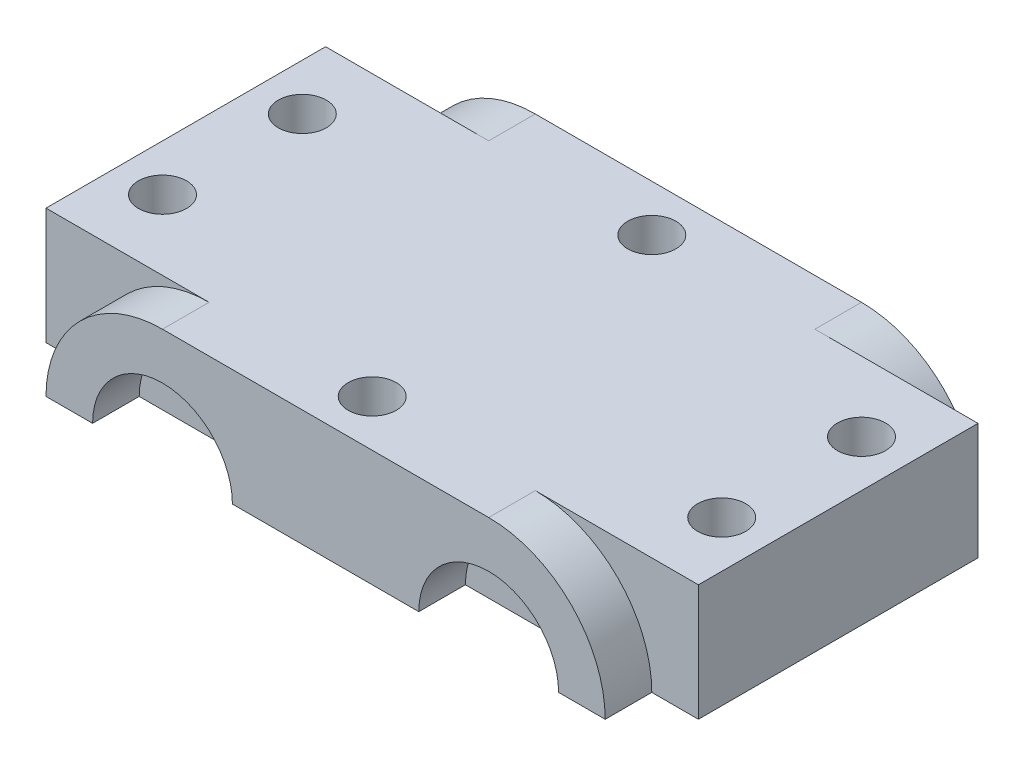
ISO-10303-21;
HEADER;
FILE_DESCRIPTION(('STEP AP214'),'2;1');
FILE_NAME('part.step','',(''),(''),'','','');
FILE_SCHEMA(('AUTOMOTIVE_DESIGN { 1 0 10303 214 1 1 1 1 }'));
ENDSEC;
DATA;
#1=APPLICATION_CONTEXT('core data for automotive mechanical design processes');
#2=APPLICATION_PROTOCOL_DEFINITION('international standard','automotive_design',2000,#1);
#3=PRODUCT_CONTEXT('',#1,'mechanical');
#4=PRODUCT('Part','Part','',(#3));
#5=PRODUCT_RELATED_PRODUCT_CATEGORY('part','',(#4));
#6=PRODUCT_DEFINITION_FORMATION('','',#4);
#7=PRODUCT_DEFINITION_CONTEXT('part definition',#1,'design');
#8=PRODUCT_DEFINITION('design','',#6,#7);
#9=PRODUCT_DEFINITION_SHAPE('','',#8);
#10=(LENGTH_UNIT() NAMED_UNIT(*) SI_UNIT(.MILLI.,.METRE.));
#11=(NAMED_UNIT(*) PLANE_ANGLE_UNIT() SI_UNIT($,.RADIAN.));
#12=(NAMED_UNIT(*) SI_UNIT($,.STERADIAN.) SOLID_ANGLE_UNIT());
#13=UNCERTAINTY_MEASURE_WITH_UNIT(LENGTH_MEASURE(1.E-05),#10,'distance_accuracy_value','');
#14=(GEOMETRIC_REPRESENTATION_CONTEXT(3) GLOBAL_UNCERTAINTY_ASSIGNED_CONTEXT((#13)) GLOBAL_UNIT_ASSIGNED_CONTEXT((#10,
#11,#12)) REPRESENTATION_CONTEXT('',''));
#15=CARTESIAN_POINT('',(0.,0.,0.));
#16=DIRECTION('',(0.,0.,1.));
#17=DIRECTION('',(1.,0.,0.));
#18=AXIS2_PLACEMENT_3D('',#15,#16,#17);
#19=CARTESIAN_POINT('',(0.,0.,-76.2));
#20=DIRECTION('',(0.,0.,-1.));
#21=DIRECTION('',(-1.,0.,0.));
#22=AXIS2_PLACEMENT_3D('',#19,#20,#21);
#23=PLANE('',#22);
#24=CARTESIAN_POINT('',(-44.45,-15.875,-76.2));
#25=DIRECTION('',(0.,0.,-1.));
#26=DIRECTION('',(-1.,0.,0.));
#27=AXIS2_PLACEMENT_3D('',#24,#25,#26);
#28=CIRCLE('',#27,31.75);
#29=CARTESIAN_POINT('',(-76.2,-15.875,-76.2));
#30=VERTEX_POINT('',#29);
#31=CARTESIAN_POINT('',(-44.45,15.875,-76.2));
#32=VERTEX_POINT('',#31);
#33=EDGE_CURVE('E196',#30,#32,#28,.T.);
#34=ORIENTED_EDGE('',*,*,#33,.F.);
#35=DIRECTION('',(1.,0.,0.));
#36=VECTOR('',#35,1.);
#37=CARTESIAN_POINT('',(-88.9,-15.875,-76.2));
#38=LINE('',#37,#36);
#39=CARTESIAN_POINT('',(-88.9,-15.875,-76.2));
#40=VERTEX_POINT('',#39);
#41=EDGE_CURVE('E261',#40,#30,#38,.T.);
#42=ORIENTED_EDGE('',*,*,#41,.F.);
#43=DIRECTION('',(0.,-1.,0.));
#44=VECTOR('',#43,1.);
#45=CARTESIAN_POINT('',(-88.9,-15.875,-76.2));
#46=LINE('',#45,#44);
#47=CARTESIAN_POINT('',(-88.9,15.875,-76.2));
#48=VERTEX_POINT('',#47);
#49=EDGE_CURVE('E256',#48,#40,#46,.T.);
#50=ORIENTED_EDGE('',*,*,#49,.F.);
#51=DIRECTION('',(-1.,0.,0.));
#52=VECTOR('',#51,1.);
#53=CARTESIAN_POINT('',(-88.9,15.875,-76.2));
#54=LINE('',#53,#52);
#55=EDGE_CURVE('E268',#32,#48,#54,.T.);
#56=ORIENTED_EDGE('',*,*,#55,.F.);
#57=EDGE_LOOP('',(#34,#42,#50,#56));
#58=FACE_BOUND('',#57,.T.);
#59=ADVANCED_FACE('F35',(#58),#23,.T.);
#60=CARTESIAN_POINT('',(-44.45,-15.875,-76.2));
#61=DIRECTION('',(0.,0.,1.));
#62=DIRECTION('',(-1.,0.,0.));
#63=AXIS2_PLACEMENT_3D('',#60,#61,#62);
#64=CIRCLE('',#63,19.05);
#65=CARTESIAN_POINT('',(-25.4,-15.875,-76.2));
#66=VERTEX_POINT('',#65);
#67=CARTESIAN_POINT('',(-63.5,-15.875,-76.2));
#68=VERTEX_POINT('',#67);
#69=EDGE_CURVE('E193',#66,#68,#64,.T.);
#70=ORIENTED_EDGE('',*,*,#69,.F.);
#71=EDGE_CURVE('E265',#68,#66,#38,.T.);
#72=ORIENTED_EDGE('',*,*,#71,.F.);
#73=EDGE_LOOP('',(#70,#72));
#74=FACE_BOUND('',#73,.T.);
#75=ADVANCED_FACE('F418',(#74),#23,.T.);
#76=CARTESIAN_POINT('',(44.45,-15.875,-76.2));
#77=DIRECTION('',(0.,0.,1.));
#78=DIRECTION('',(-1.,0.,0.));
#79=AXIS2_PLACEMENT_3D('',#76,#77,#78);
#80=CIRCLE('',#79,19.05);
#81=CARTESIAN_POINT('',(63.5,-15.875,-76.2));
#82=VERTEX_POINT('',#81);
#83=CARTESIAN_POINT('',(25.4,-15.875,-76.2));
#84=VERTEX_POINT('',#83);
#85=EDGE_CURVE('E51',#82,#84,#80,.T.);
#86=ORIENTED_EDGE('',*,*,#85,.F.);
#87=EDGE_CURVE('E54',#84,#82,#38,.T.);
#88=ORIENTED_EDGE('',*,*,#87,.F.);
#89=EDGE_LOOP('',(#86,#88));
#90=FACE_BOUND('',#89,.T.);
#91=ADVANCED_FACE('F424',(#90),#23,.T.);
#92=CARTESIAN_POINT('',(0.,0.,0.));
#93=DIRECTION('',(0.,0.,-1.));
#94=DIRECTION('',(-1.,0.,0.));
#95=AXIS2_PLACEMENT_3D('',#92,#93,#94);
#96=PLANE('',#95);
#97=CARTESIAN_POINT('',(44.45,-15.875,0.));
#98=DIRECTION('',(0.,0.,1.));
#99=DIRECTION('',(1.,0.,0.));
#100=AXIS2_PLACEMENT_3D('',#97,#98,#99);
#101=CIRCLE('',#100,31.75);
#102=CARTESIAN_POINT('',(76.2,-15.875,0.));
#103=VERTEX_POINT('',#102);
#104=CARTESIAN_POINT('',(44.45,15.875,0.));
#105=VERTEX_POINT('',#104);
#106=EDGE_CURVE('E197',#103,#105,#101,.T.);
#107=ORIENTED_EDGE('',*,*,#106,.F.);
#108=DIRECTION('',(1.,0.,0.));
#109=VECTOR('',#108,1.);
#110=CARTESIAN_POINT('',(-88.9,-15.875,0.));
#111=LINE('',#110,#109);
#112=CARTESIAN_POINT('',(88.9,-15.875,0.));
#113=VERTEX_POINT('',#112);
#114=EDGE_CURVE('E273',#103,#113,#111,.T.);
#115=ORIENTED_EDGE('',*,*,#114,.T.);
#116=DIRECTION('',(0.,1.,0.));
#117=VECTOR('',#116,1.);
#118=CARTESIAN_POINT('',(88.9,-15.875,0.));
#119=LINE('',#118,#117);
#120=CARTESIAN_POINT('',(88.9,15.875,0.));
#121=VERTEX_POINT('',#120);
#122=EDGE_CURVE('E276',#113,#121,#119,.T.);
#123=ORIENTED_EDGE('',*,*,#122,.T.);
#124=DIRECTION('',(-1.,0.,0.));
#125=VECTOR('',#124,1.);
#126=CARTESIAN_POINT('',(-88.9,15.875,0.));
#127=LINE('',#126,#125);
#128=EDGE_CURVE('E260',#121,#105,#127,.T.);
#129=ORIENTED_EDGE('',*,*,#128,.T.);
#130=EDGE_LOOP('',(#107,#115,#123,#129));
#131=FACE_BOUND('',#130,.T.);
#132=ADVANCED_FACE('F434',(#131),#96,.F.);
#133=CARTESIAN_POINT('',(44.45,-15.875,0.));
#134=DIRECTION('',(0.,0.,-1.));
#135=DIRECTION('',(-1.,0.,0.));
#136=AXIS2_PLACEMENT_3D('',#133,#134,#135);
#137=CIRCLE('',#136,19.05);
#138=CARTESIAN_POINT('',(25.4,-15.875,0.));
#139=VERTEX_POINT('',#138);
#140=CARTESIAN_POINT('',(63.5,-15.875,0.));
#141=VERTEX_POINT('',#140);
#142=EDGE_CURVE('E210',#139,#141,#137,.T.);
#143=ORIENTED_EDGE('',*,*,#142,.F.);
#144=EDGE_CURVE('E457',#139,#141,#111,.T.);
#145=ORIENTED_EDGE('',*,*,#144,.T.);
#146=EDGE_LOOP('',(#143,#145));
#147=FACE_BOUND('',#146,.T.);
#148=ADVANCED_FACE('F440',(#147),#96,.F.);
#149=CARTESIAN_POINT('',(-44.45,-15.875,0.));
#150=DIRECTION('',(0.,0.,-1.));
#151=DIRECTION('',(-1.,0.,0.));
#152=AXIS2_PLACEMENT_3D('',#149,#150,#151);
#153=CIRCLE('',#152,19.05);
#154=CARTESIAN_POINT('',(-63.5,-15.875,0.));
#155=VERTEX_POINT('',#154);
#156=CARTESIAN_POINT('',(-25.4,-15.875,0.));
#157=VERTEX_POINT('',#156);
#158=EDGE_CURVE('E227',#155,#157,#153,.T.);
#159=ORIENTED_EDGE('',*,*,#158,.F.);
#160=EDGE_CURVE('E277',#155,#157,#111,.T.);
#161=ORIENTED_EDGE('',*,*,#160,.T.);
#162=EDGE_LOOP('',(#159,#161));
#163=FACE_BOUND('',#162,.T.);
#164=ADVANCED_FACE('F435',(#163),#96,.F.);
#165=CARTESIAN_POINT('',(-88.9,-15.875,-76.2));
#166=DIRECTION('',(-1.,0.,0.));
#167=DIRECTION('',(0.,0.,1.));
#168=AXIS2_PLACEMENT_3D('',#165,#166,#167);
#169=PLANE('',#168);
#170=DIRECTION('',(0.,-1.,0.));
#171=VECTOR('',#170,1.);
#172=CARTESIAN_POINT('',(-88.9,-15.875,0.));
#173=LINE('',#172,#171);
#174=CARTESIAN_POINT('',(-88.9,15.875,0.));
#175=VERTEX_POINT('',#174);
#176=CARTESIAN_POINT('',(-88.9,-15.875,0.));
#177=VERTEX_POINT('',#176);
#178=EDGE_CURVE('E255',#175,#177,#173,.T.);
#179=ORIENTED_EDGE('',*,*,#178,.F.);
#180=DIRECTION('',(0.,0.,1.));
#181=VECTOR('',#180,1.);
#182=CARTESIAN_POINT('',(-88.9,15.875,-76.2));
#183=LINE('',#182,#181);
#184=EDGE_CURVE('E11',#48,#175,#183,.T.);
#185=ORIENTED_EDGE('',*,*,#184,.F.);
#186=ORIENTED_EDGE('',*,*,#49,.T.);
#187=DIRECTION('',(0.,0.,1.));
#188=VECTOR('',#187,1.);
#189=CARTESIAN_POINT('',(-88.9,-15.875,-76.2));
#190=LINE('',#189,#188);
#191=EDGE_CURVE('E39',#40,#177,#190,.T.);
#192=ORIENTED_EDGE('',*,*,#191,.T.);
#193=EDGE_LOOP('',(#179,#185,#186,#192));
#194=FACE_BOUND('',#193,.T.);
#195=ADVANCED_FACE('F37',(#194),#169,.T.);
#196=CARTESIAN_POINT('',(-88.9,15.875,-76.2));
#197=DIRECTION('',(0.,1.,0.));
#198=DIRECTION('',(-1.,0.,0.));
#199=AXIS2_PLACEMENT_3D('',#196,#197,#198);
#200=PLANE('',#199);
#201=CARTESIAN_POINT('',(0.,15.875,0.));
#202=DIRECTION('',(0.,1.,0.));
#203=DIRECTION('',(-1.,0.,0.));
#204=AXIS2_PLACEMENT_3D('',#201,#202,#203);
#205=CIRCLE('',#204,6.5532);
#206=CARTESIAN_POINT('',(-6.5532,15.875,0.));
#207=VERTEX_POINT('',#206);
#208=EDGE_CURVE('E362',#207,#207,#205,.T.);
#209=ORIENTED_EDGE('',*,*,#208,.F.);
#210=EDGE_LOOP('',(#209));
#211=FACE_BOUND('',#210,.T.);
#212=CARTESIAN_POINT('',(76.2,15.875,-19.05));
#213=DIRECTION('',(0.,1.,0.));
#214=DIRECTION('',(-1.,0.,0.));
#215=AXIS2_PLACEMENT_3D('',#212,#213,#214);
#216=CIRCLE('',#215,6.55319999999999);
#217=CARTESIAN_POINT('',(69.6468,15.875,-19.05));
#218=VERTEX_POINT('',#217);
#219=EDGE_CURVE('E348',#218,#218,#216,.T.);
#220=ORIENTED_EDGE('',*,*,#219,.F.);
#221=EDGE_LOOP('',(#220));
#222=FACE_BOUND('',#221,.T.);
#223=CARTESIAN_POINT('',(-76.2,15.875,-57.15));
#224=DIRECTION('',(0.,1.,0.));
#225=DIRECTION('',(-1.,0.,0.));
#226=AXIS2_PLACEMENT_3D('',#223,#224,#225);
#227=CIRCLE('',#226,6.55319999999999);
#228=CARTESIAN_POINT('',(-82.7532,15.875,-57.15));
#229=VERTEX_POINT('',#228);
#230=EDGE_CURVE('E368',#229,#229,#227,.T.);
#231=ORIENTED_EDGE('',*,*,#230,.F.);
#232=EDGE_LOOP('',(#231));
#233=FACE_BOUND('',#232,.T.);
#234=CARTESIAN_POINT('',(76.2,15.875,-57.15));
#235=DIRECTION('',(0.,1.,0.));
#236=DIRECTION('',(-1.,0.,0.));
#237=AXIS2_PLACEMENT_3D('',#234,#235,#236);
#238=CIRCLE('',#237,6.55319999999999);
#239=CARTESIAN_POINT('',(69.6468,15.875,-57.15));
#240=VERTEX_POINT('',#239);
#241=EDGE_CURVE('E349',#240,#240,#238,.T.);
#242=ORIENTED_EDGE('',*,*,#241,.F.);
#243=EDGE_LOOP('',(#242));
#244=FACE_BOUND('',#243,.T.);
#245=CARTESIAN_POINT('',(-76.2,15.875,-19.05));
#246=DIRECTION('',(0.,1.,0.));
#247=DIRECTION('',(-1.,0.,0.));
#248=AXIS2_PLACEMENT_3D('',#245,#246,#247);
#249=CIRCLE('',#248,6.55319999999999);
#250=CARTESIAN_POINT('',(-82.7532,15.875,-19.05));
#251=VERTEX_POINT('',#250);
#252=EDGE_CURVE('E356',#251,#251,#249,.T.);
#253=ORIENTED_EDGE('',*,*,#252,.F.);
#254=EDGE_LOOP('',(#253));
#255=FACE_BOUND('',#254,.T.);
#256=CARTESIAN_POINT('',(0.,15.875,-76.2));
#257=DIRECTION('',(0.,1.,0.));
#258=DIRECTION('',(-1.,0.,0.));
#259=AXIS2_PLACEMENT_3D('',#256,#257,#258);
#260=CIRCLE('',#259,6.5532);
#261=CARTESIAN_POINT('',(-6.5532,15.875,-76.2));
#262=VERTEX_POINT('',#261);
#263=EDGE_CURVE('E342',#262,#262,#260,.T.);
#264=ORIENTED_EDGE('',*,*,#263,.F.);
#265=EDGE_LOOP('',(#264));
#266=FACE_BOUND('',#265,.T.);
#267=ORIENTED_EDGE('',*,*,#128,.F.);
#268=DIRECTION('',(0.,0.,1.));
#269=VECTOR('',#268,1.);
#270=CARTESIAN_POINT('',(88.9,15.875,-76.2));
#271=LINE('',#270,#269);
#272=CARTESIAN_POINT('',(88.9,15.875,-76.2));
#273=VERTEX_POINT('',#272);
#274=EDGE_CURVE('E44',#273,#121,#271,.T.);
#275=ORIENTED_EDGE('',*,*,#274,.F.);
#276=CARTESIAN_POINT('',(44.45,15.875,-76.2));
#277=VERTEX_POINT('',#276);
#278=EDGE_CURVE('E269',#273,#277,#54,.T.);
#279=ORIENTED_EDGE('',*,*,#278,.T.);
#280=DIRECTION('',(0.,0.,1.));
#281=VECTOR('',#280,1.);
#282=CARTESIAN_POINT('',(44.45,15.875,-88.9));
#283=LINE('',#282,#281);
#284=CARTESIAN_POINT('',(44.45,15.875,-88.9));
#285=VERTEX_POINT('',#284);
#286=EDGE_CURVE('E180',#285,#277,#283,.T.);
#287=ORIENTED_EDGE('',*,*,#286,.F.);
#288=DIRECTION('',(1.,0.,0.));
#289=VECTOR('',#288,1.);
#290=CARTESIAN_POINT('',(44.45,15.875,-88.9));
#291=LINE('',#290,#289);
#292=CARTESIAN_POINT('',(-44.45,15.875,-88.9));
#293=VERTEX_POINT('',#292);
#294=EDGE_CURVE('E171',#293,#285,#291,.T.);
#295=ORIENTED_EDGE('',*,*,#294,.F.);
#296=DIRECTION('',(0.,0.,1.));
#297=VECTOR('',#296,1.);
#298=CARTESIAN_POINT('',(-44.45,15.875,-88.9));
#299=LINE('',#298,#297);
#300=EDGE_CURVE('E176',#293,#32,#299,.T.);
#301=ORIENTED_EDGE('',*,*,#300,.T.);
#302=ORIENTED_EDGE('',*,*,#55,.T.);
#303=ORIENTED_EDGE('',*,*,#184,.T.);
#304=CARTESIAN_POINT('',(-44.45,15.875,0.));
#305=VERTEX_POINT('',#304);
#306=EDGE_CURVE('E280',#305,#175,#127,.T.);
#307=ORIENTED_EDGE('',*,*,#306,.F.);
#308=DIRECTION('',(0.,0.,-1.));
#309=VECTOR('',#308,1.);
#310=CARTESIAN_POINT('',(-44.45,15.875,12.7));
#311=LINE('',#310,#309);
#312=CARTESIAN_POINT('',(-44.45,15.875,12.7));
#313=VERTEX_POINT('',#312);
#314=EDGE_CURVE('E249',#313,#305,#311,.T.);
#315=ORIENTED_EDGE('',*,*,#314,.F.);
#316=DIRECTION('',(-1.,0.,0.));
#317=VECTOR('',#316,1.);
#318=CARTESIAN_POINT('',(44.45,15.875,12.7));
#319=LINE('',#318,#317);
#320=CARTESIAN_POINT('',(44.45,15.875,12.7));
#321=VERTEX_POINT('',#320);
#322=EDGE_CURVE('E209',#321,#313,#319,.T.);
#323=ORIENTED_EDGE('',*,*,#322,.F.);
#324=DIRECTION('',(0.,0.,-1.));
#325=VECTOR('',#324,1.);
#326=CARTESIAN_POINT('',(44.45,15.875,12.7));
#327=LINE('',#326,#325);
#328=EDGE_CURVE('E252',#321,#105,#327,.T.);
#329=ORIENTED_EDGE('',*,*,#328,.T.);
#330=EDGE_LOOP('',(#267,#275,#279,#287,#295,#301,#302,#303,#307,#315,#323,#329));
#331=FACE_BOUND('',#330,.T.);
#332=ADVANCED_FACE('F174',(#211,#222,#233,#244,#255,#266,#331),#200,.T.);
#333=CARTESIAN_POINT('',(88.9,-15.875,-76.2));
#334=DIRECTION('',(1.,0.,0.));
#335=DIRECTION('',(0.,0.,-1.));
#336=AXIS2_PLACEMENT_3D('',#333,#334,#335);
#337=PLANE('',#336);
#338=ORIENTED_EDGE('',*,*,#122,.F.);
#339=DIRECTION('',(0.,0.,1.));
#340=VECTOR('',#339,1.);
#341=CARTESIAN_POINT('',(88.9,-15.875,-76.2));
#342=LINE('',#341,#340);
#343=CARTESIAN_POINT('',(88.9,-15.875,-76.2));
#344=VERTEX_POINT('',#343);
#345=EDGE_CURVE('E282',#344,#113,#342,.T.);
#346=ORIENTED_EDGE('',*,*,#345,.F.);
#347=DIRECTION('',(0.,1.,0.));
#348=VECTOR('',#347,1.);
#349=CARTESIAN_POINT('',(88.9,-15.875,-76.2));
#350=LINE('',#349,#348);
#351=EDGE_CURVE('E264',#344,#273,#350,.T.);
#352=ORIENTED_EDGE('',*,*,#351,.T.);
#353=ORIENTED_EDGE('',*,*,#274,.T.);
#354=EDGE_LOOP('',(#338,#346,#352,#353));
#355=FACE_BOUND('',#354,.T.);
#356=ADVANCED_FACE('F389',(#355),#337,.T.);
#357=CARTESIAN_POINT('',(-88.9,-15.875,-76.2));
#358=DIRECTION('',(0.,-1.,0.));
#359=DIRECTION('',(1.,0.,0.));
#360=AXIS2_PLACEMENT_3D('',#357,#358,#359);
#361=PLANE('',#360);
#362=CARTESIAN_POINT('',(0.,-15.875,0.));
#363=DIRECTION('',(0.,1.,0.));
#364=DIRECTION('',(-1.,0.,0.));
#365=AXIS2_PLACEMENT_3D('',#362,#363,#364);
#366=CIRCLE('',#365,6.5532);
#367=CARTESIAN_POINT('',(-6.5532,-15.875,0.));
#368=VERTEX_POINT('',#367);
#369=EDGE_CURVE('E332',#368,#368,#366,.T.);
#370=ORIENTED_EDGE('',*,*,#369,.T.);
#371=EDGE_LOOP('',(#370));
#372=FACE_BOUND('',#371,.T.);
#373=CARTESIAN_POINT('',(76.2,-15.875,-19.05));
#374=DIRECTION('',(0.,1.,0.));
#375=DIRECTION('',(-1.,0.,0.));
#376=AXIS2_PLACEMENT_3D('',#373,#374,#375);
#377=CIRCLE('',#376,6.55319999999999);
#378=CARTESIAN_POINT('',(69.6468,-15.875,-19.05));
#379=VERTEX_POINT('',#378);
#380=EDGE_CURVE('E365',#379,#379,#377,.T.);
#381=ORIENTED_EDGE('',*,*,#380,.T.);
#382=EDGE_LOOP('',(#381));
#383=FACE_BOUND('',#382,.T.);
#384=CARTESIAN_POINT('',(-76.2,-15.875,-57.15));
#385=DIRECTION('',(0.,1.,0.));
#386=DIRECTION('',(-1.,0.,0.));
#387=AXIS2_PLACEMENT_3D('',#384,#385,#386);
#388=CIRCLE('',#387,6.55319999999999);
#389=CARTESIAN_POINT('',(-82.7532,-15.875,-57.15));
#390=VERTEX_POINT('',#389);
#391=EDGE_CURVE('E353',#390,#390,#388,.T.);
#392=ORIENTED_EDGE('',*,*,#391,.T.);
#393=EDGE_LOOP('',(#392));
#394=FACE_BOUND('',#393,.T.);
#395=CARTESIAN_POINT('',(76.2,-15.875,-57.15));
#396=DIRECTION('',(0.,1.,0.));
#397=DIRECTION('',(-1.,0.,0.));
#398=AXIS2_PLACEMENT_3D('',#395,#396,#397);
#399=CIRCLE('',#398,6.55319999999999);
#400=CARTESIAN_POINT('',(69.6468,-15.875,-57.15));
#401=VERTEX_POINT('',#400);
#402=EDGE_CURVE('E352',#401,#401,#399,.T.);
#403=ORIENTED_EDGE('',*,*,#402,.T.);
#404=EDGE_LOOP('',(#403));
#405=FACE_BOUND('',#404,.T.);
#406=CARTESIAN_POINT('',(-76.2,-15.875,-19.05));
#407=DIRECTION('',(0.,1.,0.));
#408=DIRECTION('',(-1.,0.,0.));
#409=AXIS2_PLACEMENT_3D('',#406,#407,#408);
#410=CIRCLE('',#409,6.55319999999999);
#411=CARTESIAN_POINT('',(-82.7532,-15.875,-19.05));
#412=VERTEX_POINT('',#411);
#413=EDGE_CURVE('E359',#412,#412,#410,.T.);
#414=ORIENTED_EDGE('',*,*,#413,.T.);
#415=EDGE_LOOP('',(#414));
#416=FACE_BOUND('',#415,.T.);
#417=CARTESIAN_POINT('',(0.,-15.875,-76.2));
#418=DIRECTION('',(0.,1.,0.));
#419=DIRECTION('',(-1.,0.,0.));
#420=AXIS2_PLACEMENT_3D('',#417,#418,#419);
#421=CIRCLE('',#420,6.5532);
#422=CARTESIAN_POINT('',(-6.5532,-15.875,-76.2));
#423=VERTEX_POINT('',#422);
#424=EDGE_CURVE('E345',#423,#423,#421,.T.);
#425=ORIENTED_EDGE('',*,*,#424,.T.);
#426=EDGE_LOOP('',(#425));
#427=FACE_BOUND('',#426,.T.);
#428=CARTESIAN_POINT('',(-76.2,-15.875,0.));
#429=VERTEX_POINT('',#428);
#430=EDGE_CURVE('E274',#177,#429,#111,.T.);
#431=ORIENTED_EDGE('',*,*,#430,.F.);
#432=ORIENTED_EDGE('',*,*,#191,.F.);
#433=ORIENTED_EDGE('',*,*,#41,.T.);
#434=DIRECTION('',(0.,0.,1.));
#435=VECTOR('',#434,1.);
#436=CARTESIAN_POINT('',(-76.2,-15.875,-88.9));
#437=LINE('',#436,#435);
#438=CARTESIAN_POINT('',(-76.2,-15.875,-88.9));
#439=VERTEX_POINT('',#438);
#440=EDGE_CURVE('E302',#439,#30,#437,.T.);
#441=ORIENTED_EDGE('',*,*,#440,.F.);
#442=DIRECTION('',(-1.,0.,0.));
#443=VECTOR('',#442,1.);
#444=CARTESIAN_POINT('',(-76.2,-15.875,-88.9));
#445=LINE('',#444,#443);
#446=CARTESIAN_POINT('',(-63.5,-15.875,-88.9));
#447=VERTEX_POINT('',#446);
#448=EDGE_CURVE('E189',#447,#439,#445,.T.);
#449=ORIENTED_EDGE('',*,*,#448,.F.);
#450=DIRECTION('',(0.,0.,1.));
#451=VECTOR('',#450,1.);
#452=CARTESIAN_POINT('',(-63.5,-15.875,-88.9));
#453=LINE('',#452,#451);
#454=EDGE_CURVE('E303',#447,#68,#453,.T.);
#455=ORIENTED_EDGE('',*,*,#454,.T.);
#456=ORIENTED_EDGE('',*,*,#71,.T.);
#457=DIRECTION('',(0.,0.,1.));
#458=VECTOR('',#457,1.);
#459=CARTESIAN_POINT('',(-25.4,-15.875,-88.9));
#460=LINE('',#459,#458);
#461=CARTESIAN_POINT('',(-25.4,-15.875,-88.9));
#462=VERTEX_POINT('',#461);
#463=EDGE_CURVE('E306',#462,#66,#460,.T.);
#464=ORIENTED_EDGE('',*,*,#463,.F.);
#465=DIRECTION('',(-1.,0.,0.));
#466=VECTOR('',#465,1.);
#467=CARTESIAN_POINT('',(-25.4,-15.875,-88.9));
#468=LINE('',#467,#466);
#469=CARTESIAN_POINT('',(25.4,-15.875,-88.9));
#470=VERTEX_POINT('',#469);
#471=EDGE_CURVE('E336',#470,#462,#468,.T.);
#472=ORIENTED_EDGE('',*,*,#471,.F.);
#473=DIRECTION('',(0.,0.,1.));
#474=VECTOR('',#473,1.);
#475=CARTESIAN_POINT('',(25.4,-15.875,-88.9));
#476=LINE('',#475,#474);
#477=EDGE_CURVE('E315',#470,#84,#476,.T.);
#478=ORIENTED_EDGE('',*,*,#477,.T.);
#479=ORIENTED_EDGE('',*,*,#87,.T.);
#480=DIRECTION('',(0.,0.,1.));
#481=VECTOR('',#480,1.);
#482=CARTESIAN_POINT('',(63.5,-15.875,-88.9));
#483=LINE('',#482,#481);
#484=CARTESIAN_POINT('',(63.5,-15.875,-88.9));
#485=VERTEX_POINT('',#484);
#486=EDGE_CURVE('E318',#485,#82,#483,.T.);
#487=ORIENTED_EDGE('',*,*,#486,.F.);
#488=DIRECTION('',(-1.,0.,0.));
#489=VECTOR('',#488,1.);
#490=CARTESIAN_POINT('',(63.5,-15.875,-88.9));
#491=LINE('',#490,#489);
#492=CARTESIAN_POINT('',(76.2,-15.875,-88.9));
#493=VERTEX_POINT('',#492);
#494=EDGE_CURVE('E324',#493,#485,#491,.T.);
#495=ORIENTED_EDGE('',*,*,#494,.F.);
#496=DIRECTION('',(0.,0.,1.));
#497=VECTOR('',#496,1.);
#498=CARTESIAN_POINT('',(76.2,-15.875,-88.9));
#499=LINE('',#498,#497);
#500=CARTESIAN_POINT('',(76.2,-15.875,-76.2));
#501=VERTEX_POINT('',#500);
#502=EDGE_CURVE('E202',#493,#501,#499,.T.);
#503=ORIENTED_EDGE('',*,*,#502,.T.);
#504=EDGE_CURVE('E259',#501,#344,#38,.T.);
#505=ORIENTED_EDGE('',*,*,#504,.T.);
#506=ORIENTED_EDGE('',*,*,#345,.T.);
#507=ORIENTED_EDGE('',*,*,#114,.F.);
#508=DIRECTION('',(0.,0.,-1.));
#509=VECTOR('',#508,1.);
#510=CARTESIAN_POINT('',(76.2,-15.875,12.7));
#511=LINE('',#510,#509);
#512=CARTESIAN_POINT('',(76.2,-15.875,12.7));
#513=VERTEX_POINT('',#512);
#514=EDGE_CURVE('E223',#513,#103,#511,.T.);
#515=ORIENTED_EDGE('',*,*,#514,.F.);
#516=DIRECTION('',(1.,0.,0.));
#517=VECTOR('',#516,1.);
#518=CARTESIAN_POINT('',(63.5,-15.875,12.7));
#519=LINE('',#518,#517);
#520=CARTESIAN_POINT('',(63.5,-15.875,12.7));
#521=VERTEX_POINT('',#520);
#522=EDGE_CURVE('E222',#521,#513,#519,.T.);
#523=ORIENTED_EDGE('',*,*,#522,.F.);
#524=DIRECTION('',(0.,0.,-1.));
#525=VECTOR('',#524,1.);
#526=CARTESIAN_POINT('',(63.5,-15.875,12.7));
#527=LINE('',#526,#525);
#528=EDGE_CURVE('E234',#521,#141,#527,.T.);
#529=ORIENTED_EDGE('',*,*,#528,.T.);
#530=ORIENTED_EDGE('',*,*,#144,.F.);
#531=DIRECTION('',(0.,0.,-1.));
#532=VECTOR('',#531,1.);
#533=CARTESIAN_POINT('',(25.4,-15.875,12.7));
#534=LINE('',#533,#532);
#535=CARTESIAN_POINT('',(25.4,-15.875,12.7));
#536=VERTEX_POINT('',#535);
#537=EDGE_CURVE('E237',#536,#139,#534,.T.);
#538=ORIENTED_EDGE('',*,*,#537,.F.);
#539=DIRECTION('',(1.,0.,0.));
#540=VECTOR('',#539,1.);
#541=CARTESIAN_POINT('',(-25.4,-15.875,12.7));
#542=LINE('',#541,#540);
#543=CARTESIAN_POINT('',(-25.4,-15.875,12.7));
#544=VERTEX_POINT('',#543);
#545=EDGE_CURVE('E218',#544,#536,#542,.T.);
#546=ORIENTED_EDGE('',*,*,#545,.F.);
#547=DIRECTION('',(0.,0.,-1.));
#548=VECTOR('',#547,1.);
#549=CARTESIAN_POINT('',(-25.4,-15.875,12.7));
#550=LINE('',#549,#548);
#551=EDGE_CURVE('E240',#544,#157,#550,.T.);
#552=ORIENTED_EDGE('',*,*,#551,.T.);
#553=ORIENTED_EDGE('',*,*,#160,.F.);
#554=DIRECTION('',(0.,0.,-1.));
#555=VECTOR('',#554,1.);
#556=CARTESIAN_POINT('',(-63.5,-15.875,12.7));
#557=LINE('',#556,#555);
#558=CARTESIAN_POINT('',(-63.5,-15.875,12.7));
#559=VERTEX_POINT('',#558);
#560=EDGE_CURVE('E243',#559,#155,#557,.T.);
#561=ORIENTED_EDGE('',*,*,#560,.F.);
#562=DIRECTION('',(1.,0.,0.));
#563=VECTOR('',#562,1.);
#564=CARTESIAN_POINT('',(-76.2,-15.875,12.7));
#565=LINE('',#564,#563);
#566=CARTESIAN_POINT('',(-76.2,-15.875,12.7));
#567=VERTEX_POINT('',#566);
#568=EDGE_CURVE('E214',#567,#559,#565,.T.);
#569=ORIENTED_EDGE('',*,*,#568,.F.);
#570=DIRECTION('',(0.,0.,-1.));
#571=VECTOR('',#570,1.);
#572=CARTESIAN_POINT('',(-76.2,-15.875,12.7));
#573=LINE('',#572,#571);
#574=EDGE_CURVE('E246',#567,#429,#573,.T.);
#575=ORIENTED_EDGE('',*,*,#574,.T.);
#576=EDGE_LOOP('',(#431,#432,#433,#441,#449,#455,#456,#464,#472,#478,#479,#487,#495,#503,#505,
#506,#507,#515,#523,#529,#530,#538,#546,#552,#553,#561,#569,#575));
#577=FACE_BOUND('',#576,.T.);
#578=ADVANCED_FACE('F294',(#372,#383,#394,#405,#416,#427,#577),#361,.T.);
#579=CARTESIAN_POINT('',(44.45,-15.875,-76.2));
#580=DIRECTION('',(0.,0.,-1.));
#581=DIRECTION('',(-1.,0.,0.));
#582=AXIS2_PLACEMENT_3D('',#579,#580,#581);
#583=CIRCLE('',#582,31.75);
#584=EDGE_CURVE('E328',#277,#501,#583,.T.);
#585=ORIENTED_EDGE('',*,*,#584,.F.);
#586=ORIENTED_EDGE('',*,*,#278,.F.);
#587=ORIENTED_EDGE('',*,*,#351,.F.);
#588=ORIENTED_EDGE('',*,*,#504,.F.);
#589=EDGE_LOOP('',(#585,#586,#587,#588));
#590=FACE_BOUND('',#589,.T.);
#591=ADVANCED_FACE('F420',(#590),#23,.T.);
#592=CARTESIAN_POINT('',(-44.45,-15.875,0.));
#593=DIRECTION('',(0.,0.,1.));
#594=DIRECTION('',(1.,0.,0.));
#595=AXIS2_PLACEMENT_3D('',#592,#593,#594);
#596=CIRCLE('',#595,31.75);
#597=EDGE_CURVE('E200',#305,#429,#596,.T.);
#598=ORIENTED_EDGE('',*,*,#597,.F.);
#599=ORIENTED_EDGE('',*,*,#306,.T.);
#600=ORIENTED_EDGE('',*,*,#178,.T.);
#601=ORIENTED_EDGE('',*,*,#430,.T.);
#602=EDGE_LOOP('',(#598,#599,#600,#601));
#603=FACE_BOUND('',#602,.T.);
#604=ADVANCED_FACE('F298',(#603),#96,.F.);
#605=CARTESIAN_POINT('',(44.45,-15.875,12.7));
#606=DIRECTION('',(0.,0.,-1.));
#607=DIRECTION('',(-1.,0.,0.));
#608=AXIS2_PLACEMENT_3D('',#605,#606,#607);
#609=CYLINDRICAL_SURFACE('',#608,31.75);
#610=ORIENTED_EDGE('',*,*,#106,.T.);
#611=ORIENTED_EDGE('',*,*,#328,.F.);
#612=CARTESIAN_POINT('',(44.45,-15.875,12.7));
#613=DIRECTION('',(0.,0.,1.));
#614=DIRECTION('',(1.,0.,0.));
#615=AXIS2_PLACEMENT_3D('',#612,#613,#614);
#616=CIRCLE('',#615,31.75);
#617=EDGE_CURVE('E206',#513,#321,#616,.T.);
#618=ORIENTED_EDGE('',*,*,#617,.F.);
#619=ORIENTED_EDGE('',*,*,#514,.T.);
#620=EDGE_LOOP('',(#610,#611,#618,#619));
#621=FACE_BOUND('',#620,.T.);
#622=ADVANCED_FACE('F433',(#621),#609,.T.);
#623=CARTESIAN_POINT('',(-44.45,-15.875,12.7));
#624=DIRECTION('',(0.,0.,-1.));
#625=DIRECTION('',(-1.,0.,0.));
#626=AXIS2_PLACEMENT_3D('',#623,#624,#625);
#627=CYLINDRICAL_SURFACE('',#626,31.75);
#628=ORIENTED_EDGE('',*,*,#597,.T.);
#629=ORIENTED_EDGE('',*,*,#574,.F.);
#630=CARTESIAN_POINT('',(-44.45,-15.875,12.7));
#631=DIRECTION('',(0.,0.,1.));
#632=DIRECTION('',(1.,0.,0.));
#633=AXIS2_PLACEMENT_3D('',#630,#631,#632);
#634=CIRCLE('',#633,31.75);
#635=EDGE_CURVE('E212',#313,#567,#634,.T.);
#636=ORIENTED_EDGE('',*,*,#635,.F.);
#637=ORIENTED_EDGE('',*,*,#314,.T.);
#638=EDGE_LOOP('',(#628,#629,#636,#637));
#639=FACE_BOUND('',#638,.T.);
#640=ADVANCED_FACE('F474',(#639),#627,.T.);
#641=CARTESIAN_POINT('',(-44.45,-15.875,12.7));
#642=DIRECTION('',(0.,0.,-1.));
#643=DIRECTION('',(-1.,0.,0.));
#644=AXIS2_PLACEMENT_3D('',#641,#642,#643);
#645=CYLINDRICAL_SURFACE('',#644,19.05);
#646=ORIENTED_EDGE('',*,*,#158,.T.);
#647=ORIENTED_EDGE('',*,*,#551,.F.);
#648=CARTESIAN_POINT('',(-44.45,-15.875,12.7));
#649=DIRECTION('',(0.,0.,-1.));
#650=DIRECTION('',(-1.,0.,0.));
#651=AXIS2_PLACEMENT_3D('',#648,#649,#650);
#652=CIRCLE('',#651,19.05);
#653=EDGE_CURVE('E216',#559,#544,#652,.T.);
#654=ORIENTED_EDGE('',*,*,#653,.F.);
#655=ORIENTED_EDGE('',*,*,#560,.T.);
#656=EDGE_LOOP('',(#646,#647,#654,#655));
#657=FACE_BOUND('',#656,.T.);
#658=ADVANCED_FACE('F464',(#657),#645,.F.);
#659=CARTESIAN_POINT('',(44.45,-15.875,12.7));
#660=DIRECTION('',(0.,0.,-1.));
#661=DIRECTION('',(-1.,0.,0.));
#662=AXIS2_PLACEMENT_3D('',#659,#660,#661);
#663=CYLINDRICAL_SURFACE('',#662,19.05);
#664=ORIENTED_EDGE('',*,*,#142,.T.);
#665=ORIENTED_EDGE('',*,*,#528,.F.);
#666=CARTESIAN_POINT('',(44.45,-15.875,12.7));
#667=DIRECTION('',(0.,0.,-1.));
#668=DIRECTION('',(-1.,0.,0.));
#669=AXIS2_PLACEMENT_3D('',#666,#667,#668);
#670=CIRCLE('',#669,19.05);
#671=EDGE_CURVE('E220',#536,#521,#670,.T.);
#672=ORIENTED_EDGE('',*,*,#671,.F.);
#673=ORIENTED_EDGE('',*,*,#537,.T.);
#674=EDGE_LOOP('',(#664,#665,#672,#673));
#675=FACE_BOUND('',#674,.T.);
#676=ADVANCED_FACE('F481',(#675),#663,.F.);
#677=CARTESIAN_POINT('',(44.45,-15.875,12.7));
#678=DIRECTION('',(0.,0.,1.));
#679=DIRECTION('',(1.,0.,0.));
#680=AXIS2_PLACEMENT_3D('',#677,#678,#679);
#681=PLANE('',#680);
#682=ORIENTED_EDGE('',*,*,#617,.T.);
#683=ORIENTED_EDGE('',*,*,#322,.T.);
#684=ORIENTED_EDGE('',*,*,#635,.T.);
#685=ORIENTED_EDGE('',*,*,#568,.T.);
#686=ORIENTED_EDGE('',*,*,#653,.T.);
#687=ORIENTED_EDGE('',*,*,#545,.T.);
#688=ORIENTED_EDGE('',*,*,#671,.T.);
#689=ORIENTED_EDGE('',*,*,#522,.T.);
#690=EDGE_LOOP('',(#682,#683,#684,#685,#686,#687,#688,#689));
#691=FACE_BOUND('',#690,.T.);
#692=ADVANCED_FACE('F470',(#691),#681,.T.);
#693=CARTESIAN_POINT('',(-44.45,-15.875,-88.9));
#694=DIRECTION('',(0.,0.,1.));
#695=DIRECTION('',(1.,0.,0.));
#696=AXIS2_PLACEMENT_3D('',#693,#694,#695);
#697=CYLINDRICAL_SURFACE('',#696,31.75);
#698=ORIENTED_EDGE('',*,*,#33,.T.);
#699=ORIENTED_EDGE('',*,*,#300,.F.);
#700=CARTESIAN_POINT('',(-44.45,-15.875,-88.9));
#701=DIRECTION('',(0.,0.,-1.));
#702=DIRECTION('',(-1.,0.,0.));
#703=AXIS2_PLACEMENT_3D('',#700,#701,#702);
#704=CIRCLE('',#703,31.75);
#705=EDGE_CURVE('E184',#439,#293,#704,.T.);
#706=ORIENTED_EDGE('',*,*,#705,.F.);
#707=ORIENTED_EDGE('',*,*,#440,.T.);
#708=EDGE_LOOP('',(#698,#699,#706,#707));
#709=FACE_BOUND('',#708,.T.);
#710=ADVANCED_FACE('F195',(#709),#697,.T.);
#711=CARTESIAN_POINT('',(44.45,-15.875,-88.9));
#712=DIRECTION('',(0.,0.,1.));
#713=DIRECTION('',(1.,0.,0.));
#714=AXIS2_PLACEMENT_3D('',#711,#712,#713);
#715=CYLINDRICAL_SURFACE('',#714,31.75);
#716=ORIENTED_EDGE('',*,*,#584,.T.);
#717=ORIENTED_EDGE('',*,*,#502,.F.);
#718=CARTESIAN_POINT('',(44.45,-15.875,-88.9));
#719=DIRECTION('',(0.,0.,-1.));
#720=DIRECTION('',(-1.,0.,0.));
#721=AXIS2_PLACEMENT_3D('',#718,#719,#720);
#722=CIRCLE('',#721,31.75);
#723=EDGE_CURVE('E183',#285,#493,#722,.T.);
#724=ORIENTED_EDGE('',*,*,#723,.F.);
#725=ORIENTED_EDGE('',*,*,#286,.T.);
#726=EDGE_LOOP('',(#716,#717,#724,#725));
#727=FACE_BOUND('',#726,.T.);
#728=ADVANCED_FACE('F327',(#727),#715,.T.);
#729=CARTESIAN_POINT('',(44.45,-15.875,-88.9));
#730=DIRECTION('',(0.,0.,1.));
#731=DIRECTION('',(1.,0.,0.));
#732=AXIS2_PLACEMENT_3D('',#729,#730,#731);
#733=CYLINDRICAL_SURFACE('',#732,19.05);
#734=ORIENTED_EDGE('',*,*,#85,.T.);
#735=ORIENTED_EDGE('',*,*,#477,.F.);
#736=CARTESIAN_POINT('',(44.45,-15.875,-88.9));
#737=DIRECTION('',(0.,0.,1.));
#738=DIRECTION('',(-1.,0.,0.));
#739=AXIS2_PLACEMENT_3D('',#736,#737,#738);
#740=CIRCLE('',#739,19.05);
#741=EDGE_CURVE('E338',#485,#470,#740,.T.);
#742=ORIENTED_EDGE('',*,*,#741,.F.);
#743=ORIENTED_EDGE('',*,*,#486,.T.);
#744=EDGE_LOOP('',(#734,#735,#742,#743));
#745=FACE_BOUND('',#744,.T.);
#746=ADVANCED_FACE('F493',(#745),#733,.F.);
#747=CARTESIAN_POINT('',(-44.45,-15.875,-88.9));
#748=DIRECTION('',(0.,0.,1.));
#749=DIRECTION('',(1.,0.,0.));
#750=AXIS2_PLACEMENT_3D('',#747,#748,#749);
#751=CYLINDRICAL_SURFACE('',#750,19.05);
#752=ORIENTED_EDGE('',*,*,#69,.T.);
#753=ORIENTED_EDGE('',*,*,#454,.F.);
#754=CARTESIAN_POINT('',(-44.45,-15.875,-88.9));
#755=DIRECTION('',(0.,0.,1.));
#756=DIRECTION('',(-1.,0.,0.));
#757=AXIS2_PLACEMENT_3D('',#754,#755,#756);
#758=CIRCLE('',#757,19.05);
#759=EDGE_CURVE('E308',#462,#447,#758,.T.);
#760=ORIENTED_EDGE('',*,*,#759,.F.);
#761=ORIENTED_EDGE('',*,*,#463,.T.);
#762=EDGE_LOOP('',(#752,#753,#760,#761));
#763=FACE_BOUND('',#762,.T.);
#764=ADVANCED_FACE('F413',(#763),#751,.F.);
#765=CARTESIAN_POINT('',(-44.45,-15.875,-88.9));
#766=DIRECTION('',(0.,0.,-1.));
#767=DIRECTION('',(-1.,0.,0.));
#768=AXIS2_PLACEMENT_3D('',#765,#766,#767);
#769=PLANE('',#768);
#770=ORIENTED_EDGE('',*,*,#705,.T.);
#771=ORIENTED_EDGE('',*,*,#294,.T.);
#772=ORIENTED_EDGE('',*,*,#723,.T.);
#773=ORIENTED_EDGE('',*,*,#494,.T.);
#774=ORIENTED_EDGE('',*,*,#741,.T.);
#775=ORIENTED_EDGE('',*,*,#471,.T.);
#776=ORIENTED_EDGE('',*,*,#759,.T.);
#777=ORIENTED_EDGE('',*,*,#448,.T.);
#778=EDGE_LOOP('',(#770,#771,#772,#773,#774,#775,#776,#777));
#779=FACE_BOUND('',#778,.T.);
#780=ADVANCED_FACE('F187',(#779),#769,.T.);
#781=CARTESIAN_POINT('',(0.,-15.875,-76.2));
#782=DIRECTION('',(0.,1.,0.));
#783=DIRECTION('',(-1.,0.,0.));
#784=AXIS2_PLACEMENT_3D('',#781,#782,#783);
#785=CYLINDRICAL_SURFACE('',#784,6.5532);
#786=ORIENTED_EDGE('',*,*,#424,.F.);
#787=EDGE_LOOP('',(#786));
#788=FACE_BOUND('',#787,.T.);
#789=ORIENTED_EDGE('',*,*,#263,.T.);
#790=EDGE_LOOP('',(#789));
#791=FACE_BOUND('',#790,.T.);
#792=ADVANCED_FACE('F401',(#788,#791),#785,.F.);
#793=CARTESIAN_POINT('',(-76.2,-15.875,-19.05));
#794=DIRECTION('',(0.,1.,0.));
#795=DIRECTION('',(-1.,0.,0.));
#796=AXIS2_PLACEMENT_3D('',#793,#794,#795);
#797=CYLINDRICAL_SURFACE('',#796,6.55319999999999);
#798=ORIENTED_EDGE('',*,*,#413,.F.);
#799=EDGE_LOOP('',(#798));
#800=FACE_BOUND('',#799,.T.);
#801=ORIENTED_EDGE('',*,*,#252,.T.);
#802=EDGE_LOOP('',(#801));
#803=FACE_BOUND('',#802,.T.);
#804=ADVANCED_FACE('F403',(#800,#803),#797,.F.);
#805=CARTESIAN_POINT('',(76.2,-15.875,-57.15));
#806=DIRECTION('',(0.,1.,0.));
#807=DIRECTION('',(-1.,0.,0.));
#808=AXIS2_PLACEMENT_3D('',#805,#806,#807);
#809=CYLINDRICAL_SURFACE('',#808,6.55319999999999);
#810=ORIENTED_EDGE('',*,*,#402,.F.);
#811=EDGE_LOOP('',(#810));
#812=FACE_BOUND('',#811,.T.);
#813=ORIENTED_EDGE('',*,*,#241,.T.);
#814=EDGE_LOOP('',(#813));
#815=FACE_BOUND('',#814,.T.);
#816=ADVANCED_FACE('F410',(#812,#815),#809,.F.);
#817=CARTESIAN_POINT('',(-76.2,-15.875,-57.15));
#818=DIRECTION('',(0.,1.,0.));
#819=DIRECTION('',(-1.,0.,0.));
#820=AXIS2_PLACEMENT_3D('',#817,#818,#819);
#821=CYLINDRICAL_SURFACE('',#820,6.55319999999999);
#822=ORIENTED_EDGE('',*,*,#391,.F.);
#823=EDGE_LOOP('',(#822));
#824=FACE_BOUND('',#823,.T.);
#825=ORIENTED_EDGE('',*,*,#230,.T.);
#826=EDGE_LOOP('',(#825));
#827=FACE_BOUND('',#826,.T.);
#828=ADVANCED_FACE('F552',(#824,#827),#821,.F.);
#829=CARTESIAN_POINT('',(76.2,-15.875,-19.05));
#830=DIRECTION('',(0.,1.,0.));
#831=DIRECTION('',(-1.,0.,0.));
#832=AXIS2_PLACEMENT_3D('',#829,#830,#831);
#833=CYLINDRICAL_SURFACE('',#832,6.55319999999999);
#834=ORIENTED_EDGE('',*,*,#380,.F.);
#835=EDGE_LOOP('',(#834));
#836=FACE_BOUND('',#835,.T.);
#837=ORIENTED_EDGE('',*,*,#219,.T.);
#838=EDGE_LOOP('',(#837));
#839=FACE_BOUND('',#838,.T.);
#840=ADVANCED_FACE('F383',(#836,#839),#833,.F.);
#841=CARTESIAN_POINT('',(0.,-15.875,0.));
#842=DIRECTION('',(0.,1.,0.));
#843=DIRECTION('',(-1.,0.,0.));
#844=AXIS2_PLACEMENT_3D('',#841,#842,#843);
#845=CYLINDRICAL_SURFACE('',#844,6.5532);
#846=ORIENTED_EDGE('',*,*,#369,.F.);
#847=EDGE_LOOP('',(#846));
#848=FACE_BOUND('',#847,.T.);
#849=ORIENTED_EDGE('',*,*,#208,.T.);
#850=EDGE_LOOP('',(#849));
#851=FACE_BOUND('',#850,.T.);
#852=ADVANCED_FACE('F380',(#848,#851),#845,.F.);
#853=CLOSED_SHELL('',(#59,#75,#91,#132,#148,#164,#195,#332,#356,#578,#591,#604,#622,#640,#658,
#676,#692,#710,#728,#746,#764,#780,#792,#804,#816,#828,#840,#852));
#854=MANIFOLD_SOLID_BREP('B2',#853);
#855=ADVANCED_BREP_SHAPE_REPRESENTATION('',(#18,#854),#14);
#856=SHAPE_DEFINITION_REPRESENTATION(#9,#855);
ENDSEC;
END-ISO-10303-21;
